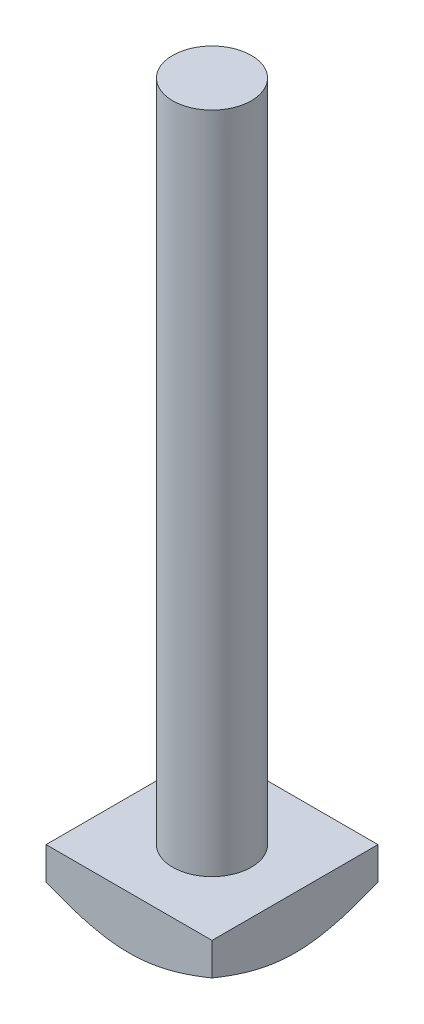
ISO-10303-21;
HEADER;
FILE_DESCRIPTION(('STEP AP214'),'2;1');
FILE_NAME('part.step','',(''),(''),'','','');
FILE_SCHEMA(('AUTOMOTIVE_DESIGN { 1 0 10303 214 1 1 1 1 }'));
ENDSEC;
DATA;
#1=APPLICATION_CONTEXT('core data for automotive mechanical design processes');
#2=APPLICATION_PROTOCOL_DEFINITION('international standard','automotive_design',2000,#1);
#3=PRODUCT_CONTEXT('',#1,'mechanical');
#4=PRODUCT('Part','Part','',(#3));
#5=PRODUCT_RELATED_PRODUCT_CATEGORY('part','',(#4));
#6=PRODUCT_DEFINITION_FORMATION('','',#4);
#7=PRODUCT_DEFINITION_CONTEXT('part definition',#1,'design');
#8=PRODUCT_DEFINITION('design','',#6,#7);
#9=PRODUCT_DEFINITION_SHAPE('','',#8);
#10=(LENGTH_UNIT() NAMED_UNIT(*) SI_UNIT(.MILLI.,.METRE.));
#11=(NAMED_UNIT(*) PLANE_ANGLE_UNIT() SI_UNIT($,.RADIAN.));
#12=(NAMED_UNIT(*) SI_UNIT($,.STERADIAN.) SOLID_ANGLE_UNIT());
#13=UNCERTAINTY_MEASURE_WITH_UNIT(LENGTH_MEASURE(1.E-05),#10,'distance_accuracy_value','');
#14=(GEOMETRIC_REPRESENTATION_CONTEXT(3) GLOBAL_UNCERTAINTY_ASSIGNED_CONTEXT((#13)) GLOBAL_UNIT_ASSIGNED_CONTEXT((#10,
#11,#12)) REPRESENTATION_CONTEXT('',''));
#15=CARTESIAN_POINT('',(0.,0.,0.));
#16=DIRECTION('',(0.,0.,1.));
#17=DIRECTION('',(1.,0.,0.));
#18=AXIS2_PLACEMENT_3D('',#15,#16,#17);
#19=CARTESIAN_POINT('',(0.,6.,0.));
#20=DIRECTION('',(1.,0.,0.));
#21=DIRECTION('',(0.,0.,-1.));
#22=AXIS2_PLACEMENT_3D('',#19,#20,#21);
#23=PLANE('',#22);
#24=CARTESIAN_POINT('',(0.,6.68834594844931,-28.3230831588063));
#25=CARTESIAN_POINT('',(0.,6.45070380772682,-27.8619507005066));
#26=CARTESIAN_POINT('',(0.,6.21440342928749,-27.4001199101472));
#27=CARTESIAN_POINT('',(0.,5.74520287332573,-26.474700340612));
#28=CARTESIAN_POINT('',(0.,5.51230290212758,-26.0111114568937));
#29=CARTESIAN_POINT('',(0.,5.05011174600072,-25.0807891484722));
#30=CARTESIAN_POINT('',(0.,4.82083021685997,-24.6140509173531));
#31=CARTESIAN_POINT('',(0.,4.3674589482454,-23.6780666700227));
#32=CARTESIAN_POINT('',(0.,4.14336910367954,-23.2088207048111));
#33=CARTESIAN_POINT('',(0.,3.68941094393633,-22.2410365236015));
#34=CARTESIAN_POINT('',(0.,3.45991604717514,-21.7423226113332));
#35=CARTESIAN_POINT('',(0.,3.01031519445254,-20.740626700145));
#36=CARTESIAN_POINT('',(0.,2.79020976718959,-20.2376444627928));
#37=CARTESIAN_POINT('',(0.,2.36254478456671,-19.2268682439152));
#38=CARTESIAN_POINT('',(0.,2.15497444808882,-18.7190788446584));
#39=CARTESIAN_POINT('',(0.,1.75626030956971,-17.6970817582177));
#40=CARTESIAN_POINT('',(0.,1.56511439179872,-17.1828749075075));
#41=CARTESIAN_POINT('',(0.,1.29598425699956,-16.4086781559412));
#42=CARTESIAN_POINT('',(0.,1.20964425187435,-16.1515898864284));
#43=CARTESIAN_POINT('',(0.,1.043248833163,-15.6354090837821));
#44=CARTESIAN_POINT('',(0.,0.963192767902775,-15.3763167615478));
#45=CARTESIAN_POINT('',(0.,0.810320387214313,-14.8560032440093));
#46=CARTESIAN_POINT('',(0.,0.737503686977488,-14.5947821626589));
#47=CARTESIAN_POINT('',(0.,0.600152574695191,-14.0700892797129));
#48=CARTESIAN_POINT('',(0.,0.535621117585811,-13.8066167106575));
#49=CARTESIAN_POINT('',(0.,0.358566274681855,-13.0232296285116));
#50=CARTESIAN_POINT('',(0.,0.259490063240945,-12.5001023968332));
#51=CARTESIAN_POINT('',(0.,0.144618984529614,-11.7106604153946));
#52=CARTESIAN_POINT('',(0.,0.111953320563671,-11.4467350980246));
#53=CARTESIAN_POINT('',(0.,0.0586980049060026,-10.9176790782439));
#54=CARTESIAN_POINT('',(0.,0.0381069607477823,-10.652548518379));
#55=CARTESIAN_POINT('',(0.,0.0066003725951142,-10.0654815240203));
#56=CARTESIAN_POINT('',(0.,-0.00135095791655024,-9.74338079114066));
#57=CARTESIAN_POINT('',(0.,0.00172693629809304,-9.0993088801639));
#58=CARTESIAN_POINT('',(0.,0.0127542440880129,-8.77733769226751));
#59=CARTESIAN_POINT('',(0.,0.0532974584283697,-8.13448727880437));
#60=CARTESIAN_POINT('',(0.,0.0828184316709812,-7.81360837672044));
#61=CARTESIAN_POINT('',(0.,0.159126782139937,-7.17391785013963));
#62=CARTESIAN_POINT('',(0.,0.20591518262266,-6.85510634929512));
#63=CARTESIAN_POINT('',(0.,0.316540584816504,-6.21143682423213));
#64=CARTESIAN_POINT('',(0.,0.380811705360535,-5.88665415115691));
#65=CARTESIAN_POINT('',(0.,0.523667130273871,-5.24027966037051));
#66=CARTESIAN_POINT('',(0.,0.60225168687916,-4.91868789899594));
#67=CARTESIAN_POINT('',(0.,0.771684497792505,-4.27862172860382));
#68=CARTESIAN_POINT('',(0.,0.862538063330151,-3.96014873408988));
#69=CARTESIAN_POINT('',(0.,1.00655697378711,-3.48482004698336));
#70=CARTESIAN_POINT('',(0.,1.05585231038632,-3.32677609768554));
#71=CARTESIAN_POINT('',(0.,1.15681176351801,-3.01144608230806));
#72=CARTESIAN_POINT('',(0.,1.20847587831453,-2.85416001567309));
#73=CARTESIAN_POINT('',(0.,1.35928941656249,-2.40548671271407));
#74=CARTESIAN_POINT('',(0.,1.4610985957599,-2.11499186791928));
#75=CARTESIAN_POINT('',(0.,1.67105499189568,-1.53629398321283));
#76=CARTESIAN_POINT('',(0.,1.77920260147701,-1.2480910865377));
#77=CARTESIAN_POINT('',(0.,2.00089076814567,-0.673699373026265));
#78=CARTESIAN_POINT('',(0.,2.11443249545393,-0.387511008835022));
#79=CARTESIAN_POINT('',(0.,2.34608721924841,0.18301275220982));
#80=CARTESIAN_POINT('',(0.,2.46420033815325,0.467348099202371));
#81=CARTESIAN_POINT('',(0.,2.82457914295012,1.3184129497224));
#82=CARTESIAN_POINT('',(0.,3.07267766329292,1.88267355593106));
#83=CARTESIAN_POINT('',(0.,3.58024674254604,3.00594145084987));
#84=CARTESIAN_POINT('',(0.,3.83971606095398,3.56494930457076));
#85=CARTESIAN_POINT('',(0.,4.36811572595606,4.68074783022574));
#86=CARTESIAN_POINT('',(0.,4.63707473339781,5.23752489491209));
#87=CARTESIAN_POINT('',(0.,5.18160552341579,6.34784190916271));
#88=CARTESIAN_POINT('',(0.,5.45717745278125,6.90138178653023));
#89=CARTESIAN_POINT('',(0.,6.01331612323407,8.00556174861765));
#90=CARTESIAN_POINT('',(0.,6.29388004174384,8.55620325734742));
#91=CARTESIAN_POINT('',(0.,6.85908276662002,9.65538212106813));
#92=CARTESIAN_POINT('',(0.,7.14372153978459,10.2039194931574));
#93=CARTESIAN_POINT('',(0.,7.92540348179011,11.699426536769));
#94=CARTESIAN_POINT('',(0.,8.42569687377211,12.6446965845977));
#95=CARTESIAN_POINT('',(0.,9.43322432522653,14.5317090425054));
#96=CARTESIAN_POINT('',(0.,9.94045945257296,15.4734508807869));
#97=CARTESIAN_POINT('',(0.,10.9565043510568,17.347820902972));
#98=CARTESIAN_POINT('',(0.,11.4652800685171,18.2804675607473));
#99=CARTESIAN_POINT('',(0.,12.2312060446628,19.6778133081124));
#100=CARTESIAN_POINT('',(0.,12.4869522304876,20.1432831834054));
#101=CARTESIAN_POINT('',(0.,12.9992707604769,21.0737671042349));
#102=CARTESIAN_POINT('',(0.,13.2558431032863,21.5387811505174));
#103=CARTESIAN_POINT('',(0.,13.5127742209984,22.0035969371847));
#104=B_SPLINE_CURVE_WITH_KNOTS('',3,(#24,#25,#26,#27,#28,#29,#30,#31,#32,#33,#34,#35,#36,#37,
#38,#39,#40,#41,#42,#43,#44,#45,#46,#47,#48,#49,#50,#51,#52,#53,#54,#55,#56,#57,#58,#59,#60,#61,
#62,#63,#64,#65,#66,#67,#68,#69,#70,#71,#72,#73,#74,#75,#76,#77,#78,#79,#80,#81,#82,#83,#84,#85,
#86,#87,#88,#89,#90,#91,#92,#93,#94,#95,#96,#97,#98,#99,#100,#101,#102,#103),.UNSPECIFIED.,.F.,
.F.,(4,2,2,2,2,2,2,2,2,2,2,2,2,2,2,2,2,2,2,2,2,2,2,2,2,2,2,2,2,2,2,2,2,2,2,2,2,2,2,4),(0.,
1.55630134137729,3.11269672424296,4.67271284597383,6.23269736163176,7.8795764889748,
9.52654822605102,11.1720826550907,12.8174047940098,13.6309367357944,14.444384198724,
15.2577883996937,16.0714819005493,17.6668272258889,18.4644168368812,19.2619144503322,
20.2279423051799,21.1938725921601,22.1600676299572,23.1263199330326,24.1191886397429,
25.1120748447987,26.1053922544731,26.6020373721119,27.0986821257919,28.0220428359497,
28.9454608055647,29.8690800281271,30.7927240016933,32.6417114389066,34.4904976597252,
36.345448194249,38.200439941885,40.054414220624,41.9083734018061,45.1168258693479,
48.3257775810441,51.5129495264836,53.1062520579699,54.6995519770881),.UNSPECIFIED.);
#105=CARTESIAN_POINT('',(0.,2.27188996151194,0.));
#106=VERTEX_POINT('',#105);
#107=CARTESIAN_POINT('',(0.,0.,-9.5));
#108=VERTEX_POINT('',#107);
#109=EDGE_CURVE('E135',#106,#108,#104,.F.);
#110=ORIENTED_EDGE('',*,*,#109,.F.);
#111=DIRECTION('',(0.,-1.,0.));
#112=VECTOR('',#111,1.);
#113=CARTESIAN_POINT('',(0.,6.,0.));
#114=LINE('',#113,#112);
#115=CARTESIAN_POINT('',(0.,6.,0.));
#116=VERTEX_POINT('',#115);
#117=EDGE_CURVE('E196',#116,#106,#114,.T.);
#118=ORIENTED_EDGE('',*,*,#117,.F.);
#119=DIRECTION('',(0.,0.,1.));
#120=VECTOR('',#119,1.);
#121=CARTESIAN_POINT('',(0.,6.,0.));
#122=LINE('',#121,#120);
#123=CARTESIAN_POINT('',(0.,6.,-19.));
#124=VERTEX_POINT('',#123);
#125=EDGE_CURVE('E179',#124,#116,#122,.T.);
#126=ORIENTED_EDGE('',*,*,#125,.F.);
#127=DIRECTION('',(0.,-1.,0.));
#128=VECTOR('',#127,1.);
#129=CARTESIAN_POINT('',(0.,6.,-19.));
#130=LINE('',#129,#128);
#131=CARTESIAN_POINT('',(0.,2.27188996151194,-19.));
#132=VERTEX_POINT('',#131);
#133=EDGE_CURVE('E190',#124,#132,#130,.T.);
#134=ORIENTED_EDGE('',*,*,#133,.T.);
#135=EDGE_CURVE('E117',#108,#132,#104,.F.);
#136=ORIENTED_EDGE('',*,*,#135,.F.);
#137=EDGE_LOOP('',(#110,#118,#126,#134,#136));
#138=FACE_BOUND('',#137,.T.);
#139=ADVANCED_FACE('F51',(#138),#23,.F.);
#140=CARTESIAN_POINT('',(0.,6.,0.));
#141=DIRECTION('',(0.,0.,-1.));
#142=DIRECTION('',(-1.,0.,0.));
#143=AXIS2_PLACEMENT_3D('',#140,#141,#142);
#144=PLANE('',#143);
#145=CARTESIAN_POINT('',(-9.32308315880634,6.68834594844931,0.));
#146=CARTESIAN_POINT('',(-8.86195070050657,6.45070380772682,0.));
#147=CARTESIAN_POINT('',(-8.40011991014719,6.21440342928749,0.));
#148=CARTESIAN_POINT('',(-7.47470034061196,5.74520287332573,0.));
#149=CARTESIAN_POINT('',(-7.0111114568937,5.51230290212758,0.));
#150=CARTESIAN_POINT('',(-6.08078914847224,5.05011174600072,0.));
#151=CARTESIAN_POINT('',(-5.61405091735309,4.82083021685997,0.));
#152=CARTESIAN_POINT('',(-4.67806667002274,4.3674589482454,0.));
#153=CARTESIAN_POINT('',(-4.20882070481108,4.14336910367954,0.));
#154=CARTESIAN_POINT('',(-3.2410365236015,3.68941094393633,0.));
#155=CARTESIAN_POINT('',(-2.7423226113332,3.45991604717514,0.));
#156=CARTESIAN_POINT('',(-1.74062670014499,3.01031519445254,0.));
#157=CARTESIAN_POINT('',(-1.23764446279278,2.79020976718959,0.));
#158=CARTESIAN_POINT('',(-0.226868243915205,2.36254478456671,0.));
#159=CARTESIAN_POINT('',(0.28092115534158,2.15497444808882,0.));
#160=CARTESIAN_POINT('',(1.30291824178226,1.75626030956971,0.));
#161=CARTESIAN_POINT('',(1.8171250924925,1.56511439179872,0.));
#162=CARTESIAN_POINT('',(2.5913218440588,1.29598425699956,0.));
#163=CARTESIAN_POINT('',(2.84841011357156,1.20964425187435,0.));
#164=CARTESIAN_POINT('',(3.36459091621786,1.043248833163,0.));
#165=CARTESIAN_POINT('',(3.62368323845225,0.963192767902773,0.));
#166=CARTESIAN_POINT('',(4.1439967559907,0.810320387214311,0.));
#167=CARTESIAN_POINT('',(4.40521783734106,0.737503686977487,0.));
#168=CARTESIAN_POINT('',(4.92991072028708,0.60015257469519,0.));
#169=CARTESIAN_POINT('',(5.19338328934254,0.535621117585809,0.));
#170=CARTESIAN_POINT('',(5.97677037148838,0.358566274681853,0.));
#171=CARTESIAN_POINT('',(6.4998976031668,0.259490063240942,0.));
#172=CARTESIAN_POINT('',(7.2893395846054,0.144618984529612,0.));
#173=CARTESIAN_POINT('',(7.55326490197538,0.11195332056367,0.));
#174=CARTESIAN_POINT('',(8.08232092175611,0.0586980049060016,0.));
#175=CARTESIAN_POINT('',(8.34745148162101,0.0381069607477806,0.));
#176=CARTESIAN_POINT('',(8.93451847597974,0.00660037259511185,0.));
#177=CARTESIAN_POINT('',(9.25661920885934,-0.00135095791655243,0.));
#178=CARTESIAN_POINT('',(9.9006911198361,0.00172693629809122,0.));
#179=CARTESIAN_POINT('',(10.2226623077325,0.0127542440880112,0.));
#180=CARTESIAN_POINT('',(10.8655127211956,0.0532974584283675,0.));
#181=CARTESIAN_POINT('',(11.1863916232796,0.0828184316709783,0.));
#182=CARTESIAN_POINT('',(11.8260821498604,0.159126782139934,0.));
#183=CARTESIAN_POINT('',(12.1448936507049,0.205915182622658,0.));
#184=CARTESIAN_POINT('',(12.7885631757679,0.316540584816502,0.));
#185=CARTESIAN_POINT('',(13.1133458488431,0.380811705360533,0.));
#186=CARTESIAN_POINT('',(13.7597203396295,0.523667130273867,0.));
#187=CARTESIAN_POINT('',(14.0813121010041,0.602251686879156,0.));
#188=CARTESIAN_POINT('',(14.7213782713962,0.771684497792501,0.));
#189=CARTESIAN_POINT('',(15.0398512659101,0.862538063330147,0.));
#190=CARTESIAN_POINT('',(15.5151799530166,1.00655697378711,0.));
#191=CARTESIAN_POINT('',(15.6732239023145,1.05585231038632,0.));
#192=CARTESIAN_POINT('',(15.9885539176919,1.156811763518,0.));
#193=CARTESIAN_POINT('',(16.1458399843269,1.20847587831453,0.));
#194=CARTESIAN_POINT('',(16.5945132872859,1.35928941656248,0.));
#195=CARTESIAN_POINT('',(16.8850081320807,1.4610985957599,0.));
#196=CARTESIAN_POINT('',(17.4637060167872,1.67105499189567,0.));
#197=CARTESIAN_POINT('',(17.7519089134623,1.779202601477,0.));
#198=CARTESIAN_POINT('',(18.3263006269737,2.00089076814566,0.));
#199=CARTESIAN_POINT('',(18.612488991165,2.11443249545392,0.));
#200=CARTESIAN_POINT('',(19.1830127522098,2.3460872192484,0.));
#201=CARTESIAN_POINT('',(19.4673480992024,2.46420033815324,0.));
#202=CARTESIAN_POINT('',(20.3184129497224,2.82457914295011,0.));
#203=CARTESIAN_POINT('',(20.882673555931,3.07267766329291,0.));
#204=CARTESIAN_POINT('',(22.0059414508499,3.58024674254603,0.));
#205=CARTESIAN_POINT('',(22.5649493045707,3.83971606095397,0.));
#206=CARTESIAN_POINT('',(23.6807478302257,4.36811572595605,0.));
#207=CARTESIAN_POINT('',(24.2375248949121,4.6370747333978,0.));
#208=CARTESIAN_POINT('',(25.3478419091627,5.18160552341577,0.));
#209=CARTESIAN_POINT('',(25.9013817865302,5.45717745278123,0.));
#210=CARTESIAN_POINT('',(27.0055617486176,6.01331612323404,0.));
#211=CARTESIAN_POINT('',(27.5562032573474,6.29388004174382,0.));
#212=CARTESIAN_POINT('',(28.6553821210681,6.85908276662,0.));
#213=CARTESIAN_POINT('',(29.2039194931574,7.14372153978457,0.));
#214=CARTESIAN_POINT('',(30.6994265367689,7.92540348179008,0.));
#215=CARTESIAN_POINT('',(31.6446965845977,8.42569687377208,0.));
#216=CARTESIAN_POINT('',(33.5317090425054,9.43322432522651,0.));
#217=CARTESIAN_POINT('',(34.4734508807869,9.94045945257294,0.));
#218=CARTESIAN_POINT('',(36.347820902972,10.9565043510567,0.));
#219=CARTESIAN_POINT('',(37.2804675607473,11.4652800685171,0.));
#220=CARTESIAN_POINT('',(38.6778133081124,12.2312060446628,0.));
#221=CARTESIAN_POINT('',(39.1432831834054,12.4869522304876,0.));
#222=CARTESIAN_POINT('',(40.0737671042348,12.9992707604769,0.));
#223=CARTESIAN_POINT('',(40.5387811505174,13.2558431032863,0.));
#224=CARTESIAN_POINT('',(41.0035969371847,13.5127742209984,0.));
#225=B_SPLINE_CURVE_WITH_KNOTS('',3,(#145,#146,#147,#148,#149,#150,#151,#152,#153,#154,#155,
#156,#157,#158,#159,#160,#161,#162,#163,#164,#165,#166,#167,#168,#169,#170,#171,#172,#173,#174,
#175,#176,#177,#178,#179,#180,#181,#182,#183,#184,#185,#186,#187,#188,#189,#190,#191,#192,#193,
#194,#195,#196,#197,#198,#199,#200,#201,#202,#203,#204,#205,#206,#207,#208,#209,#210,#211,#212,
#213,#214,#215,#216,#217,#218,#219,#220,#221,#222,#223,#224),.UNSPECIFIED.,.F.,.F.,(4,2,2,2,2,2,
2,2,2,2,2,2,2,2,2,2,2,2,2,2,2,2,2,2,2,2,2,2,2,2,2,2,2,2,2,2,2,2,2,4),(0.,1.55630134137729,
3.11269672424296,4.67271284597383,6.23269736163176,7.8795764889748,9.52654822605102,
11.1720826550907,12.8174047940098,13.6309367357944,14.444384198724,15.2577883996937,
16.0714819005493,17.6668272258889,18.4644168368812,19.2619144503322,20.2279423051799,
21.1938725921601,22.1600676299572,23.1263199330326,24.1191886397429,25.1120748447987,
26.1053922544731,26.6020373721119,27.0986821257919,28.0220428359497,28.9454608055647,
29.869080028127,30.7927240016933,32.6417114389066,34.4904976597252,36.345448194249,
38.2004399418849,40.0544142206239,41.908373401806,45.1168258693478,48.3257775810441,
51.5129495264835,53.1062520579698,54.699551977088),.UNSPECIFIED.);
#226=CARTESIAN_POINT('',(19.,2.27188996151194,0.));
#227=VERTEX_POINT('',#226);
#228=CARTESIAN_POINT('',(9.50000000000001,0.,0.));
#229=VERTEX_POINT('',#228);
#230=EDGE_CURVE('E124',#227,#229,#225,.F.);
#231=ORIENTED_EDGE('',*,*,#230,.F.);
#232=DIRECTION('',(0.,-1.,0.));
#233=VECTOR('',#232,1.);
#234=CARTESIAN_POINT('',(19.,6.,0.));
#235=LINE('',#234,#233);
#236=CARTESIAN_POINT('',(19.,6.,0.));
#237=VERTEX_POINT('',#236);
#238=EDGE_CURVE('E133',#237,#227,#235,.T.);
#239=ORIENTED_EDGE('',*,*,#238,.F.);
#240=DIRECTION('',(1.,0.,0.));
#241=VECTOR('',#240,1.);
#242=CARTESIAN_POINT('',(0.,6.,0.));
#243=LINE('',#242,#241);
#244=EDGE_CURVE('E182',#116,#237,#243,.T.);
#245=ORIENTED_EDGE('',*,*,#244,.F.);
#246=ORIENTED_EDGE('',*,*,#117,.T.);
#247=EDGE_CURVE('E134',#229,#106,#225,.F.);
#248=ORIENTED_EDGE('',*,*,#247,.F.);
#249=EDGE_LOOP('',(#231,#239,#245,#246,#248));
#250=FACE_BOUND('',#249,.T.);
#251=ADVANCED_FACE('F167',(#250),#144,.F.);
#252=CARTESIAN_POINT('',(19.,6.,0.));
#253=DIRECTION('',(-1.,0.,0.));
#254=DIRECTION('',(0.,0.,1.));
#255=AXIS2_PLACEMENT_3D('',#252,#253,#254);
#256=PLANE('',#255);
#257=CARTESIAN_POINT('',(19.,6.68834594844931,-28.3230831588063));
#258=CARTESIAN_POINT('',(19.,6.45070380772682,-27.8619507005066));
#259=CARTESIAN_POINT('',(19.,6.21440342928748,-27.4001199101472));
#260=CARTESIAN_POINT('',(19.,5.74520287332573,-26.474700340612));
#261=CARTESIAN_POINT('',(19.,5.51230290212758,-26.0111114568937));
#262=CARTESIAN_POINT('',(19.,5.05011174600072,-25.0807891484722));
#263=CARTESIAN_POINT('',(19.,4.82083021685997,-24.6140509173531));
#264=CARTESIAN_POINT('',(19.,4.3674589482454,-23.6780666700227));
#265=CARTESIAN_POINT('',(19.,4.14336910367954,-23.2088207048111));
#266=CARTESIAN_POINT('',(19.,3.68941094393632,-22.2410365236015));
#267=CARTESIAN_POINT('',(19.,3.45991604717513,-21.7423226113332));
#268=CARTESIAN_POINT('',(19.,3.01031519445254,-20.740626700145));
#269=CARTESIAN_POINT('',(19.,2.79020976718959,-20.2376444627928));
#270=CARTESIAN_POINT('',(19.,2.36254478456671,-19.2268682439152));
#271=CARTESIAN_POINT('',(19.,2.15497444808882,-18.7190788446584));
#272=CARTESIAN_POINT('',(19.,1.75626030956971,-17.6970817582177));
#273=CARTESIAN_POINT('',(19.,1.56511439179872,-17.1828749075075));
#274=CARTESIAN_POINT('',(19.,1.29598425699956,-16.4086781559412));
#275=CARTESIAN_POINT('',(19.,1.20964425187435,-16.1515898864284));
#276=CARTESIAN_POINT('',(19.,1.043248833163,-15.6354090837821));
#277=CARTESIAN_POINT('',(19.,0.963192767902773,-15.3763167615478));
#278=CARTESIAN_POINT('',(19.,0.810320387214311,-14.8560032440093));
#279=CARTESIAN_POINT('',(19.,0.737503686977486,-14.5947821626589));
#280=CARTESIAN_POINT('',(19.,0.600152574695189,-14.0700892797129));
#281=CARTESIAN_POINT('',(19.,0.535621117585809,-13.8066167106575));
#282=CARTESIAN_POINT('',(19.,0.358566274681853,-13.0232296285116));
#283=CARTESIAN_POINT('',(19.,0.259490063240943,-12.5001023968332));
#284=CARTESIAN_POINT('',(19.,0.144618984529612,-11.7106604153946));
#285=CARTESIAN_POINT('',(19.,0.111953320563669,-11.4467350980246));
#286=CARTESIAN_POINT('',(19.,0.0586980049060006,-10.9176790782439));
#287=CARTESIAN_POINT('',(19.,0.0381069607477803,-10.652548518379));
#288=CARTESIAN_POINT('',(19.,0.00660037259511221,-10.0654815240203));
#289=CARTESIAN_POINT('',(19.,-0.00135095791655229,-9.74338079114066));
#290=CARTESIAN_POINT('',(19.,0.00172693629809108,-9.0993088801639));
#291=CARTESIAN_POINT('',(19.,0.0127542440880111,-8.77733769226751));
#292=CARTESIAN_POINT('',(19.,0.0532974584283676,-8.13448727880438));
#293=CARTESIAN_POINT('',(19.,0.0828184316709784,-7.81360837672044));
#294=CARTESIAN_POINT('',(19.,0.159126782139934,-7.17391785013963));
#295=CARTESIAN_POINT('',(19.,0.205915182622658,-6.85510634929512));
#296=CARTESIAN_POINT('',(19.,0.316540584816502,-6.21143682423213));
#297=CARTESIAN_POINT('',(19.,0.380811705360533,-5.88665415115691));
#298=CARTESIAN_POINT('',(19.,0.523667130273869,-5.24027966037051));
#299=CARTESIAN_POINT('',(19.,0.602251686879158,-4.91868789899594));
#300=CARTESIAN_POINT('',(19.,0.771684497792503,-4.27862172860382));
#301=CARTESIAN_POINT('',(19.,0.862538063330148,-3.96014873408988));
#302=CARTESIAN_POINT('',(19.,1.00655697378711,-3.48482004698336));
#303=CARTESIAN_POINT('',(19.,1.05585231038632,-3.32677609768554));
#304=CARTESIAN_POINT('',(19.,1.15681176351801,-3.01144608230806));
#305=CARTESIAN_POINT('',(19.,1.20847587831453,-2.85416001567309));
#306=CARTESIAN_POINT('',(19.,1.35928941656248,-2.40548671271407));
#307=CARTESIAN_POINT('',(19.,1.4610985957599,-2.11499186791928));
#308=CARTESIAN_POINT('',(19.,1.67105499189567,-1.53629398321283));
#309=CARTESIAN_POINT('',(19.,1.779202601477,-1.24809108653771));
#310=CARTESIAN_POINT('',(19.,2.00089076814566,-0.673699373026268));
#311=CARTESIAN_POINT('',(19.,2.11443249545392,-0.387511008835025));
#312=CARTESIAN_POINT('',(19.,2.3460872192484,0.183012752209817));
#313=CARTESIAN_POINT('',(19.,2.46420033815325,0.467348099202367));
#314=CARTESIAN_POINT('',(19.,2.82457914295012,1.3184129497224));
#315=CARTESIAN_POINT('',(19.,3.07267766329292,1.88267355593106));
#316=CARTESIAN_POINT('',(19.,3.58024674254604,3.00594145084987));
#317=CARTESIAN_POINT('',(19.,3.83971606095398,3.56494930457075));
#318=CARTESIAN_POINT('',(19.,4.36811572595606,4.68074783022573));
#319=CARTESIAN_POINT('',(19.,4.63707473339781,5.23752489491208));
#320=CARTESIAN_POINT('',(19.,5.18160552341579,6.3478419091627));
#321=CARTESIAN_POINT('',(19.,5.45717745278124,6.90138178653022));
#322=CARTESIAN_POINT('',(19.,6.01331612323406,8.00556174861764));
#323=CARTESIAN_POINT('',(19.,6.29388004174384,8.55620325734741));
#324=CARTESIAN_POINT('',(19.,6.85908276662002,9.65538212106811));
#325=CARTESIAN_POINT('',(19.,7.14372153978459,10.2039194931574));
#326=CARTESIAN_POINT('',(19.,7.9254034817901,11.6994265367689));
#327=CARTESIAN_POINT('',(19.,8.4256968737721,12.6446965845977));
#328=CARTESIAN_POINT('',(19.,9.43322432522652,14.5317090425054));
#329=CARTESIAN_POINT('',(19.,9.94045945257295,15.4734508807869));
#330=CARTESIAN_POINT('',(19.,10.9565043510568,17.347820902972));
#331=CARTESIAN_POINT('',(19.,11.4652800685171,18.2804675607473));
#332=CARTESIAN_POINT('',(19.,12.2312060446628,19.6778133081124));
#333=CARTESIAN_POINT('',(19.,12.4869522304876,20.1432831834054));
#334=CARTESIAN_POINT('',(19.,12.9992707604769,21.0737671042348));
#335=CARTESIAN_POINT('',(19.,13.2558431032863,21.5387811505174));
#336=CARTESIAN_POINT('',(19.,13.5127742209984,22.0035969371847));
#337=B_SPLINE_CURVE_WITH_KNOTS('',3,(#257,#258,#259,#260,#261,#262,#263,#264,#265,#266,#267,
#268,#269,#270,#271,#272,#273,#274,#275,#276,#277,#278,#279,#280,#281,#282,#283,#284,#285,#286,
#287,#288,#289,#290,#291,#292,#293,#294,#295,#296,#297,#298,#299,#300,#301,#302,#303,#304,#305,
#306,#307,#308,#309,#310,#311,#312,#313,#314,#315,#316,#317,#318,#319,#320,#321,#322,#323,#324,
#325,#326,#327,#328,#329,#330,#331,#332,#333,#334,#335,#336),.UNSPECIFIED.,.F.,.F.,(4,2,2,2,2,2,
2,2,2,2,2,2,2,2,2,2,2,2,2,2,2,2,2,2,2,2,2,2,2,2,2,2,2,2,2,2,2,2,2,4),(0.,1.55630134137729,
3.11269672424296,4.67271284597383,6.23269736163176,7.8795764889748,9.52654822605102,
11.1720826550907,12.8174047940098,13.6309367357944,14.444384198724,15.2577883996937,
16.0714819005493,17.6668272258889,18.4644168368812,19.2619144503322,20.2279423051799,
21.1938725921601,22.1600676299572,23.1263199330326,24.1191886397429,25.1120748447987,
26.1053922544731,26.6020373721119,27.0986821257919,28.0220428359497,28.9454608055647,
29.8690800281271,30.7927240016933,32.6417114389066,34.4904976597252,36.345448194249,
38.200439941885,40.054414220624,41.9083734018061,45.1168258693479,48.3257775810441,
51.5129495264835,53.1062520579699,54.6995519770881),.UNSPECIFIED.);
#338=CARTESIAN_POINT('',(19.,2.27188996151194,-19.));
#339=VERTEX_POINT('',#338);
#340=CARTESIAN_POINT('',(19.,0.,-9.5));
#341=VERTEX_POINT('',#340);
#342=EDGE_CURVE('E107',#339,#341,#337,.T.);
#343=ORIENTED_EDGE('',*,*,#342,.F.);
#344=DIRECTION('',(0.,-1.,0.));
#345=VECTOR('',#344,1.);
#346=CARTESIAN_POINT('',(19.,6.,-19.));
#347=LINE('',#346,#345);
#348=CARTESIAN_POINT('',(19.,6.,-19.));
#349=VERTEX_POINT('',#348);
#350=EDGE_CURVE('E193',#349,#339,#347,.T.);
#351=ORIENTED_EDGE('',*,*,#350,.F.);
#352=DIRECTION('',(0.,0.,-1.));
#353=VECTOR('',#352,1.);
#354=CARTESIAN_POINT('',(19.,6.,0.));
#355=LINE('',#354,#353);
#356=EDGE_CURVE('E185',#237,#349,#355,.T.);
#357=ORIENTED_EDGE('',*,*,#356,.F.);
#358=ORIENTED_EDGE('',*,*,#238,.T.);
#359=EDGE_CURVE('E120',#341,#227,#337,.T.);
#360=ORIENTED_EDGE('',*,*,#359,.F.);
#361=EDGE_LOOP('',(#343,#351,#357,#358,#360));
#362=FACE_BOUND('',#361,.T.);
#363=ADVANCED_FACE('F130',(#362),#256,.F.);
#364=CARTESIAN_POINT('',(0.,6.,-19.));
#365=DIRECTION('',(0.,0.,1.));
#366=DIRECTION('',(1.,0.,0.));
#367=AXIS2_PLACEMENT_3D('',#364,#365,#366);
#368=PLANE('',#367);
#369=CARTESIAN_POINT('',(-9.32308315880634,6.68834594844931,-19.));
#370=CARTESIAN_POINT('',(-8.86195070050657,6.45070380772682,-19.));
#371=CARTESIAN_POINT('',(-8.40011991014719,6.21440342928749,-19.));
#372=CARTESIAN_POINT('',(-7.47470034061196,5.74520287332573,-19.));
#373=CARTESIAN_POINT('',(-7.0111114568937,5.51230290212758,-19.));
#374=CARTESIAN_POINT('',(-6.08078914847224,5.05011174600072,-19.));
#375=CARTESIAN_POINT('',(-5.61405091735309,4.82083021685997,-19.));
#376=CARTESIAN_POINT('',(-4.67806667002274,4.3674589482454,-19.));
#377=CARTESIAN_POINT('',(-4.20882070481108,4.14336910367954,-19.));
#378=CARTESIAN_POINT('',(-3.2410365236015,3.68941094393633,-19.));
#379=CARTESIAN_POINT('',(-2.7423226113332,3.45991604717514,-19.));
#380=CARTESIAN_POINT('',(-1.74062670014499,3.01031519445254,-19.));
#381=CARTESIAN_POINT('',(-1.23764446279278,2.79020976718959,-19.));
#382=CARTESIAN_POINT('',(-0.226868243915205,2.36254478456671,-19.));
#383=CARTESIAN_POINT('',(0.28092115534158,2.15497444808882,-19.));
#384=CARTESIAN_POINT('',(1.30291824178226,1.75626030956971,-19.));
#385=CARTESIAN_POINT('',(1.8171250924925,1.56511439179872,-19.));
#386=CARTESIAN_POINT('',(2.5913218440588,1.29598425699956,-19.));
#387=CARTESIAN_POINT('',(2.84841011357156,1.20964425187435,-19.));
#388=CARTESIAN_POINT('',(3.36459091621786,1.043248833163,-19.));
#389=CARTESIAN_POINT('',(3.62368323845225,0.963192767902774,-19.));
#390=CARTESIAN_POINT('',(4.1439967559907,0.810320387214311,-19.));
#391=CARTESIAN_POINT('',(4.40521783734106,0.737503686977486,-19.));
#392=CARTESIAN_POINT('',(4.92991072028708,0.600152574695189,-19.));
#393=CARTESIAN_POINT('',(5.19338328934254,0.535621117585809,-19.));
#394=CARTESIAN_POINT('',(5.97677037148838,0.358566274681853,-19.));
#395=CARTESIAN_POINT('',(6.4998976031668,0.259490063240942,-19.));
#396=CARTESIAN_POINT('',(7.2893395846054,0.144618984529612,-19.));
#397=CARTESIAN_POINT('',(7.55326490197538,0.11195332056367,-19.));
#398=CARTESIAN_POINT('',(8.08232092175611,0.0586980049060016,-19.));
#399=CARTESIAN_POINT('',(8.34745148162101,0.0381069607477806,-19.));
#400=CARTESIAN_POINT('',(8.93451847597974,0.00660037259511184,-19.));
#401=CARTESIAN_POINT('',(9.25661920885934,-0.00135095791655243,-19.));
#402=CARTESIAN_POINT('',(9.9006911198361,0.00172693629809122,-19.));
#403=CARTESIAN_POINT('',(10.2226623077325,0.0127542440880112,-19.));
#404=CARTESIAN_POINT('',(10.8655127211956,0.0532974584283675,-19.));
#405=CARTESIAN_POINT('',(11.1863916232796,0.0828184316709783,-19.));
#406=CARTESIAN_POINT('',(11.8260821498604,0.159126782139934,-19.));
#407=CARTESIAN_POINT('',(12.1448936507049,0.205915182622658,-19.));
#408=CARTESIAN_POINT('',(12.7885631757679,0.316540584816502,-19.));
#409=CARTESIAN_POINT('',(13.1133458488431,0.380811705360533,-19.));
#410=CARTESIAN_POINT('',(13.7597203396295,0.523667130273867,-19.));
#411=CARTESIAN_POINT('',(14.0813121010041,0.602251686879156,-19.));
#412=CARTESIAN_POINT('',(14.7213782713962,0.771684497792501,-19.));
#413=CARTESIAN_POINT('',(15.0398512659101,0.862538063330147,-19.));
#414=CARTESIAN_POINT('',(15.5151799530166,1.00655697378711,-19.));
#415=CARTESIAN_POINT('',(15.6732239023145,1.05585231038632,-19.));
#416=CARTESIAN_POINT('',(15.9885539176919,1.156811763518,-19.));
#417=CARTESIAN_POINT('',(16.1458399843269,1.20847587831453,-19.));
#418=CARTESIAN_POINT('',(16.5945132872859,1.35928941656248,-19.));
#419=CARTESIAN_POINT('',(16.8850081320807,1.4610985957599,-19.));
#420=CARTESIAN_POINT('',(17.4637060167872,1.67105499189567,-19.));
#421=CARTESIAN_POINT('',(17.7519089134623,1.779202601477,-19.));
#422=CARTESIAN_POINT('',(18.3263006269737,2.00089076814566,-19.));
#423=CARTESIAN_POINT('',(18.612488991165,2.11443249545392,-19.));
#424=CARTESIAN_POINT('',(19.1830127522098,2.3460872192484,-19.));
#425=CARTESIAN_POINT('',(19.4673480992024,2.46420033815324,-19.));
#426=CARTESIAN_POINT('',(20.3184129497224,2.82457914295011,-19.));
#427=CARTESIAN_POINT('',(20.882673555931,3.07267766329291,-19.));
#428=CARTESIAN_POINT('',(22.0059414508498,3.58024674254602,-19.));
#429=CARTESIAN_POINT('',(22.5649493045707,3.83971606095397,-19.));
#430=CARTESIAN_POINT('',(23.6807478302257,4.36811572595605,-19.));
#431=CARTESIAN_POINT('',(24.2375248949121,4.6370747333978,-19.));
#432=CARTESIAN_POINT('',(25.3478419091627,5.18160552341578,-19.));
#433=CARTESIAN_POINT('',(25.9013817865302,5.45717745278124,-19.));
#434=CARTESIAN_POINT('',(27.0055617486176,6.01331612323405,-19.));
#435=CARTESIAN_POINT('',(27.5562032573474,6.29388004174383,-19.));
#436=CARTESIAN_POINT('',(28.6553821210681,6.85908276662001,-19.));
#437=CARTESIAN_POINT('',(29.2039194931574,7.14372153978457,-19.));
#438=CARTESIAN_POINT('',(30.6994265367689,7.92540348179009,-19.));
#439=CARTESIAN_POINT('',(31.6446965845977,8.42569687377209,-19.));
#440=CARTESIAN_POINT('',(33.5317090425054,9.43322432522651,-19.));
#441=CARTESIAN_POINT('',(34.4734508807869,9.94045945257294,-19.));
#442=CARTESIAN_POINT('',(36.347820902972,10.9565043510567,-19.));
#443=CARTESIAN_POINT('',(37.2804675607473,11.4652800685171,-19.));
#444=CARTESIAN_POINT('',(38.6778133081124,12.2312060446628,-19.));
#445=CARTESIAN_POINT('',(39.1432831834054,12.4869522304876,-19.));
#446=CARTESIAN_POINT('',(40.0737671042348,12.9992707604769,-19.));
#447=CARTESIAN_POINT('',(40.5387811505174,13.2558431032863,-19.));
#448=CARTESIAN_POINT('',(41.0035969371847,13.5127742209984,-19.));
#449=B_SPLINE_CURVE_WITH_KNOTS('',3,(#369,#370,#371,#372,#373,#374,#375,#376,#377,#378,#379,
#380,#381,#382,#383,#384,#385,#386,#387,#388,#389,#390,#391,#392,#393,#394,#395,#396,#397,#398,
#399,#400,#401,#402,#403,#404,#405,#406,#407,#408,#409,#410,#411,#412,#413,#414,#415,#416,#417,
#418,#419,#420,#421,#422,#423,#424,#425,#426,#427,#428,#429,#430,#431,#432,#433,#434,#435,#436,
#437,#438,#439,#440,#441,#442,#443,#444,#445,#446,#447,#448),.UNSPECIFIED.,.F.,.F.,(4,2,2,2,2,2,
2,2,2,2,2,2,2,2,2,2,2,2,2,2,2,2,2,2,2,2,2,2,2,2,2,2,2,2,2,2,2,2,2,4),(0.,1.55630134137729,
3.11269672424296,4.67271284597383,6.23269736163176,7.8795764889748,9.52654822605102,
11.1720826550907,12.8174047940098,13.6309367357944,14.444384198724,15.2577883996937,
16.0714819005493,17.6668272258889,18.4644168368812,19.2619144503322,20.2279423051799,
21.1938725921601,22.1600676299572,23.1263199330326,24.1191886397429,25.1120748447987,
26.1053922544731,26.6020373721119,27.0986821257919,28.0220428359497,28.9454608055647,
29.869080028127,30.7927240016933,32.6417114389066,34.4904976597252,36.345448194249,
38.200439941885,40.0544142206239,41.908373401806,45.1168258693478,48.3257775810441,
51.5129495264835,53.1062520579699,54.699551977088),.UNSPECIFIED.);
#450=CARTESIAN_POINT('',(9.50000000000001,0.,-19.));
#451=VERTEX_POINT('',#450);
#452=EDGE_CURVE('E118',#132,#451,#449,.T.);
#453=ORIENTED_EDGE('',*,*,#452,.F.);
#454=ORIENTED_EDGE('',*,*,#133,.F.);
#455=DIRECTION('',(-1.,0.,0.));
#456=VECTOR('',#455,1.);
#457=CARTESIAN_POINT('',(0.,6.,-19.));
#458=LINE('',#457,#456);
#459=EDGE_CURVE('E74',#349,#124,#458,.T.);
#460=ORIENTED_EDGE('',*,*,#459,.F.);
#461=ORIENTED_EDGE('',*,*,#350,.T.);
#462=EDGE_CURVE('E112',#451,#339,#449,.T.);
#463=ORIENTED_EDGE('',*,*,#462,.F.);
#464=EDGE_LOOP('',(#453,#454,#460,#461,#463));
#465=FACE_BOUND('',#464,.T.);
#466=ADVANCED_FACE('F175',(#465),#368,.F.);
#467=CARTESIAN_POINT('',(0.,6.,0.));
#468=DIRECTION('',(0.,-1.,0.));
#469=DIRECTION('',(0.,0.,-1.));
#470=AXIS2_PLACEMENT_3D('',#467,#468,#469);
#471=PLANE('',#470);
#472=CARTESIAN_POINT('',(9.5,6.00000000000001,-9.5));
#473=DIRECTION('',(0.,-1.,0.));
#474=DIRECTION('',(0.,0.,-1.));
#475=AXIS2_PLACEMENT_3D('',#472,#473,#474);
#476=CIRCLE('',#475,4.5);
#477=CARTESIAN_POINT('',(9.5,6.00000000000001,-14.));
#478=VERTEX_POINT('',#477);
#479=EDGE_CURVE('E197',#478,#478,#476,.F.);
#480=ORIENTED_EDGE('',*,*,#479,.F.);
#481=EDGE_LOOP('',(#480));
#482=FACE_BOUND('',#481,.T.);
#483=ORIENTED_EDGE('',*,*,#125,.T.);
#484=ORIENTED_EDGE('',*,*,#244,.T.);
#485=ORIENTED_EDGE('',*,*,#356,.T.);
#486=ORIENTED_EDGE('',*,*,#459,.T.);
#487=EDGE_LOOP('',(#483,#484,#485,#486));
#488=FACE_BOUND('',#487,.T.);
#489=ADVANCED_FACE('F208',(#482,#488),#471,.F.);
#490=CARTESIAN_POINT('',(9.5,82.,-9.5));
#491=DIRECTION('',(0.,-1.,0.));
#492=DIRECTION('',(0.,0.,-1.));
#493=AXIS2_PLACEMENT_3D('',#490,#491,#492);
#494=CYLINDRICAL_SURFACE('',#493,4.5);
#495=CARTESIAN_POINT('',(9.5,82.,-9.5));
#496=DIRECTION('',(0.,1.,0.));
#497=DIRECTION('',(0.,0.,1.));
#498=AXIS2_PLACEMENT_3D('',#495,#496,#497);
#499=CIRCLE('',#498,4.5);
#500=CARTESIAN_POINT('',(9.5,82.,-5.));
#501=VERTEX_POINT('',#500);
#502=EDGE_CURVE('E165',#501,#501,#499,.T.);
#503=ORIENTED_EDGE('',*,*,#502,.F.);
#504=EDGE_LOOP('',(#503));
#505=FACE_BOUND('',#504,.T.);
#506=ORIENTED_EDGE('',*,*,#479,.T.);
#507=EDGE_LOOP('',(#506));
#508=FACE_BOUND('',#507,.T.);
#509=ADVANCED_FACE('F210',(#505,#508),#494,.T.);
#510=CARTESIAN_POINT('',(9.5,82.,-9.5));
#511=DIRECTION('',(0.,1.,0.));
#512=DIRECTION('',(0.,0.,1.));
#513=AXIS2_PLACEMENT_3D('',#510,#511,#512);
#514=PLANE('',#513);
#515=ORIENTED_EDGE('',*,*,#502,.T.);
#516=EDGE_LOOP('',(#515));
#517=FACE_BOUND('',#516,.T.);
#518=ADVANCED_FACE('F156',(#517),#514,.T.);
#519=CARTESIAN_POINT('',(9.50000000000001,0.,-9.5));
#520=DIRECTION('',(0.,1.,0.));
#521=DIRECTION('',(0.,0.,-1.));
#522=AXIS2_PLACEMENT_3D('',#519,#520,#521);
#523=CONICAL_SURFACE('',#522,9.5,1.0471975511966);
#524=ORIENTED_EDGE('',*,*,#135,.T.);
#525=ORIENTED_EDGE('',*,*,#452,.T.);
#526=CARTESIAN_POINT('',(9.50000000000001,0.,-9.5));
#527=DIRECTION('',(0.,-1.,0.));
#528=DIRECTION('',(0.,0.,-1.));
#529=AXIS2_PLACEMENT_3D('',#526,#527,#528);
#530=CIRCLE('',#529,9.5);
#531=EDGE_CURVE('E55',#108,#451,#530,.T.);
#532=ORIENTED_EDGE('',*,*,#531,.F.);
#533=EDGE_LOOP('',(#524,#525,#532));
#534=FACE_BOUND('',#533,.T.);
#535=ADVANCED_FACE('F206',(#534),#523,.T.);
#536=ORIENTED_EDGE('',*,*,#247,.T.);
#537=ORIENTED_EDGE('',*,*,#109,.T.);
#538=EDGE_CURVE('E60',#229,#108,#530,.T.);
#539=ORIENTED_EDGE('',*,*,#538,.F.);
#540=EDGE_LOOP('',(#536,#537,#539));
#541=FACE_BOUND('',#540,.T.);
#542=ADVANCED_FACE('F155',(#541),#523,.T.);
#543=ORIENTED_EDGE('',*,*,#230,.T.);
#544=EDGE_CURVE('E13',#341,#229,#530,.T.);
#545=ORIENTED_EDGE('',*,*,#544,.F.);
#546=ORIENTED_EDGE('',*,*,#359,.T.);
#547=EDGE_LOOP('',(#543,#545,#546));
#548=FACE_BOUND('',#547,.T.);
#549=ADVANCED_FACE('F122',(#548),#523,.T.);
#550=ORIENTED_EDGE('',*,*,#342,.T.);
#551=CARTESIAN_POINT('',(9.50000000000001,0.,-9.5));
#552=DIRECTION('',(0.,-1.,0.));
#553=DIRECTION('',(0.,0.,-1.));
#554=AXIS2_PLACEMENT_3D('',#551,#552,#553);
#555=CIRCLE('',#554,9.5);
#556=EDGE_CURVE('E110',#451,#341,#555,.T.);
#557=ORIENTED_EDGE('',*,*,#556,.F.);
#558=ORIENTED_EDGE('',*,*,#462,.T.);
#559=EDGE_LOOP('',(#550,#557,#558));
#560=FACE_BOUND('',#559,.T.);
#561=ADVANCED_FACE('F109',(#560),#523,.T.);
#562=CARTESIAN_POINT('',(0.,0.,0.));
#563=DIRECTION('',(0.,-1.,0.));
#564=DIRECTION('',(0.,0.,-1.));
#565=AXIS2_PLACEMENT_3D('',#562,#563,#564);
#566=PLANE('',#565);
#567=ORIENTED_EDGE('',*,*,#531,.T.);
#568=ORIENTED_EDGE('',*,*,#556,.T.);
#569=ORIENTED_EDGE('',*,*,#544,.T.);
#570=ORIENTED_EDGE('',*,*,#538,.T.);
#571=EDGE_LOOP('',(#567,#568,#569,#570));
#572=FACE_BOUND('',#571,.T.);
#573=ADVANCED_FACE('F127',(#572),#566,.T.);
#574=CLOSED_SHELL('',(#139,#251,#363,#466,#489,#509,#518,#535,#542,#549,#561,#573));
#575=MANIFOLD_SOLID_BREP('B2',#574);
#576=ADVANCED_BREP_SHAPE_REPRESENTATION('',(#18,#575),#14);
#577=SHAPE_DEFINITION_REPRESENTATION(#9,#576);
ENDSEC;
END-ISO-10303-21;
